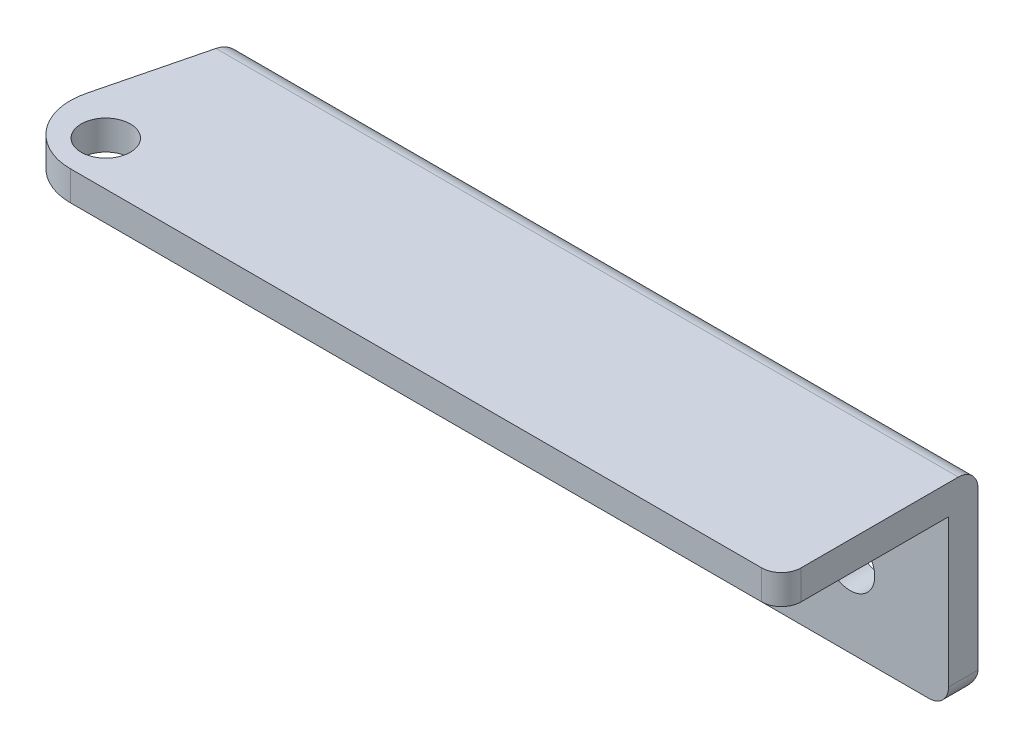
ISO-10303-21;
HEADER;
FILE_DESCRIPTION(('STEP AP214'),'2;1');
FILE_NAME('part.step','',(''),(''),'','','');
FILE_SCHEMA(('AUTOMOTIVE_DESIGN { 1 0 10303 214 1 1 1 1 }'));
ENDSEC;
DATA;
#1=APPLICATION_CONTEXT('core data for automotive mechanical design processes');
#2=APPLICATION_PROTOCOL_DEFINITION('international standard','automotive_design',2000,#1);
#3=PRODUCT_CONTEXT('',#1,'mechanical');
#4=PRODUCT('Part','Part','',(#3));
#5=PRODUCT_RELATED_PRODUCT_CATEGORY('part','',(#4));
#6=PRODUCT_DEFINITION_FORMATION('','',#4);
#7=PRODUCT_DEFINITION_CONTEXT('part definition',#1,'design');
#8=PRODUCT_DEFINITION('design','',#6,#7);
#9=PRODUCT_DEFINITION_SHAPE('','',#8);
#10=(LENGTH_UNIT() NAMED_UNIT(*) SI_UNIT(.MILLI.,.METRE.));
#11=(NAMED_UNIT(*) PLANE_ANGLE_UNIT() SI_UNIT($,.RADIAN.));
#12=(NAMED_UNIT(*) SI_UNIT($,.STERADIAN.) SOLID_ANGLE_UNIT());
#13=UNCERTAINTY_MEASURE_WITH_UNIT(LENGTH_MEASURE(1.E-05),#10,'distance_accuracy_value','');
#14=(GEOMETRIC_REPRESENTATION_CONTEXT(3) GLOBAL_UNCERTAINTY_ASSIGNED_CONTEXT((#13)) GLOBAL_UNIT_ASSIGNED_CONTEXT((#10,
#11,#12)) REPRESENTATION_CONTEXT('',''));
#15=CARTESIAN_POINT('',(0.,0.,0.));
#16=DIRECTION('',(0.,0.,1.));
#17=DIRECTION('',(1.,0.,0.));
#18=AXIS2_PLACEMENT_3D('',#15,#16,#17);
#19=CARTESIAN_POINT('',(0.,20.,0.));
#20=DIRECTION('',(1.,0.,0.));
#21=DIRECTION('',(0.,0.,-1.));
#22=AXIS2_PLACEMENT_3D('',#19,#20,#21);
#23=PLANE('',#22);
#24=DIRECTION('',(0.,-1.,0.));
#25=VECTOR('',#24,1.);
#26=CARTESIAN_POINT('',(0.,20.,-3.));
#27=LINE('',#26,#25);
#28=CARTESIAN_POINT('',(0.,17.,-3.));
#29=VERTEX_POINT('',#28);
#30=CARTESIAN_POINT('',(0.,2.,-3.));
#31=VERTEX_POINT('',#30);
#32=EDGE_CURVE('E218',#29,#31,#27,.T.);
#33=ORIENTED_EDGE('',*,*,#32,.T.);
#34=DIRECTION('',(0.,0.,1.));
#35=VECTOR('',#34,1.);
#36=CARTESIAN_POINT('',(0.,2.,0.));
#37=LINE('',#36,#35);
#38=CARTESIAN_POINT('',(0.,2.,0.));
#39=VERTEX_POINT('',#38);
#40=EDGE_CURVE('E60',#31,#39,#37,.T.);
#41=ORIENTED_EDGE('',*,*,#40,.T.);
#42=DIRECTION('',(0.,-1.,0.));
#43=VECTOR('',#42,1.);
#44=CARTESIAN_POINT('',(0.,20.,0.));
#45=LINE('',#44,#43);
#46=CARTESIAN_POINT('',(0.,17.,0.));
#47=VERTEX_POINT('',#46);
#48=EDGE_CURVE('E150',#47,#39,#45,.T.);
#49=ORIENTED_EDGE('',*,*,#48,.F.);
#50=DIRECTION('',(0.,0.,1.));
#51=VECTOR('',#50,1.);
#52=CARTESIAN_POINT('',(0.,17.,0.));
#53=LINE('',#52,#51);
#54=EDGE_CURVE('E131',#29,#47,#53,.T.);
#55=ORIENTED_EDGE('',*,*,#54,.F.);
#56=EDGE_LOOP('',(#33,#41,#49,#55));
#57=FACE_BOUND('',#56,.T.);
#58=ADVANCED_FACE('F37',(#57),#23,.F.);
#59=CARTESIAN_POINT('',(0.,20.,0.));
#60=DIRECTION('',(0.,0.,-1.));
#61=DIRECTION('',(-1.,0.,0.));
#62=AXIS2_PLACEMENT_3D('',#59,#60,#61);
#63=PLANE('',#62);
#64=CARTESIAN_POINT('',(65.,8.,0.));
#65=DIRECTION('',(0.,0.,1.));
#66=DIRECTION('',(1.,0.,0.));
#67=AXIS2_PLACEMENT_3D('',#64,#65,#66);
#68=CIRCLE('',#67,2.49999999999999);
#69=CARTESIAN_POINT('',(67.5,8.,0.));
#70=VERTEX_POINT('',#69);
#71=EDGE_CURVE('E464',#70,#70,#68,.T.);
#72=ORIENTED_EDGE('',*,*,#71,.F.);
#73=EDGE_LOOP('',(#72));
#74=FACE_BOUND('',#73,.T.);
#75=CARTESIAN_POINT('',(15.,8.,0.));
#76=DIRECTION('',(0.,0.,1.));
#77=DIRECTION('',(1.,0.,0.));
#78=AXIS2_PLACEMENT_3D('',#75,#76,#77);
#79=CIRCLE('',#78,2.5);
#80=CARTESIAN_POINT('',(17.5,8.,0.));
#81=VERTEX_POINT('',#80);
#82=EDGE_CURVE('E465',#81,#81,#79,.T.);
#83=ORIENTED_EDGE('',*,*,#82,.F.);
#84=EDGE_LOOP('',(#83));
#85=FACE_BOUND('',#84,.T.);
#86=ORIENTED_EDGE('',*,*,#48,.T.);
#87=CARTESIAN_POINT('',(2.,2.,0.));
#88=DIRECTION('',(0.,0.,-1.));
#89=DIRECTION('',(-1.,0.,0.));
#90=AXIS2_PLACEMENT_3D('',#87,#88,#89);
#91=CIRCLE('',#90,2.);
#92=CARTESIAN_POINT('',(2.,0.,0.));
#93=VERTEX_POINT('',#92);
#94=EDGE_CURVE('E193',#39,#93,#91,.F.);
#95=ORIENTED_EDGE('',*,*,#94,.T.);
#96=DIRECTION('',(1.,0.,0.));
#97=VECTOR('',#96,1.);
#98=CARTESIAN_POINT('',(0.,0.,0.));
#99=LINE('',#98,#97);
#100=CARTESIAN_POINT('',(73.,0.,0.));
#101=VERTEX_POINT('',#100);
#102=EDGE_CURVE('E219',#93,#101,#99,.T.);
#103=ORIENTED_EDGE('',*,*,#102,.T.);
#104=CARTESIAN_POINT('',(73.,2.,0.));
#105=DIRECTION('',(0.,0.,-1.));
#106=DIRECTION('',(-1.,0.,0.));
#107=AXIS2_PLACEMENT_3D('',#104,#105,#106);
#108=CIRCLE('',#107,2.);
#109=CARTESIAN_POINT('',(75.,2.,0.));
#110=VERTEX_POINT('',#109);
#111=EDGE_CURVE('E149',#101,#110,#108,.F.);
#112=ORIENTED_EDGE('',*,*,#111,.T.);
#113=DIRECTION('',(0.,-1.,0.));
#114=VECTOR('',#113,1.);
#115=CARTESIAN_POINT('',(75.,20.,0.));
#116=LINE('',#115,#114);
#117=CARTESIAN_POINT('',(75.,17.,0.));
#118=VERTEX_POINT('',#117);
#119=EDGE_CURVE('E139',#118,#110,#116,.T.);
#120=ORIENTED_EDGE('',*,*,#119,.F.);
#121=DIRECTION('',(1.,0.,0.));
#122=VECTOR('',#121,1.);
#123=CARTESIAN_POINT('',(0.,17.,0.));
#124=LINE('',#123,#122);
#125=EDGE_CURVE('E125',#47,#118,#124,.T.);
#126=ORIENTED_EDGE('',*,*,#125,.F.);
#127=EDGE_LOOP('',(#86,#95,#103,#112,#120,#126));
#128=FACE_BOUND('',#127,.T.);
#129=ADVANCED_FACE('F146',(#74,#85,#128),#63,.F.);
#130=CARTESIAN_POINT('',(75.,20.,0.));
#131=DIRECTION('',(-1.,0.,0.));
#132=DIRECTION('',(0.,0.,1.));
#133=AXIS2_PLACEMENT_3D('',#130,#131,#132);
#134=PLANE('',#133);
#135=DIRECTION('',(0.,-1.,0.));
#136=VECTOR('',#135,1.);
#137=CARTESIAN_POINT('',(75.,20.,-3.));
#138=LINE('',#137,#136);
#139=CARTESIAN_POINT('',(75.,18.,-3.));
#140=VERTEX_POINT('',#139);
#141=CARTESIAN_POINT('',(75.,2.,-3.));
#142=VERTEX_POINT('',#141);
#143=EDGE_CURVE('E151',#140,#142,#138,.T.);
#144=ORIENTED_EDGE('',*,*,#143,.F.);
#145=CARTESIAN_POINT('',(75.,18.,-1.));
#146=DIRECTION('',(-1.,0.,0.));
#147=DIRECTION('',(0.,0.,1.));
#148=AXIS2_PLACEMENT_3D('',#145,#146,#147);
#149=CIRCLE('',#148,2.);
#150=CARTESIAN_POINT('',(75.,20.,-1.));
#151=VERTEX_POINT('',#150);
#152=EDGE_CURVE('E189',#140,#151,#149,.F.);
#153=ORIENTED_EDGE('',*,*,#152,.T.);
#154=DIRECTION('',(0.,0.,-1.));
#155=VECTOR('',#154,1.);
#156=CARTESIAN_POINT('',(75.,20.,0.));
#157=LINE('',#156,#155);
#158=CARTESIAN_POINT('',(75.,20.,15.));
#159=VERTEX_POINT('',#158);
#160=EDGE_CURVE('E215',#159,#151,#157,.T.);
#161=ORIENTED_EDGE('',*,*,#160,.F.);
#162=DIRECTION('',(0.,1.,0.));
#163=VECTOR('',#162,1.);
#164=CARTESIAN_POINT('',(75.,17.,15.));
#165=LINE('',#164,#163);
#166=CARTESIAN_POINT('',(75.,17.,15.));
#167=VERTEX_POINT('',#166);
#168=EDGE_CURVE('E143',#159,#167,#165,.F.);
#169=ORIENTED_EDGE('',*,*,#168,.T.);
#170=DIRECTION('',(0.,0.,1.));
#171=VECTOR('',#170,1.);
#172=CARTESIAN_POINT('',(75.,17.,0.));
#173=LINE('',#172,#171);
#174=EDGE_CURVE('E128',#118,#167,#173,.T.);
#175=ORIENTED_EDGE('',*,*,#174,.F.);
#176=ORIENTED_EDGE('',*,*,#119,.T.);
#177=DIRECTION('',(0.,0.,-1.));
#178=VECTOR('',#177,1.);
#179=CARTESIAN_POINT('',(75.,2.,-3.));
#180=LINE('',#179,#178);
#181=EDGE_CURVE('E187',#110,#142,#180,.T.);
#182=ORIENTED_EDGE('',*,*,#181,.T.);
#183=EDGE_LOOP('',(#144,#153,#161,#169,#175,#176,#182));
#184=FACE_BOUND('',#183,.T.);
#185=ADVANCED_FACE('F138',(#184),#134,.F.);
#186=CARTESIAN_POINT('',(0.,20.,-3.));
#187=DIRECTION('',(0.,0.,1.));
#188=DIRECTION('',(1.,0.,0.));
#189=AXIS2_PLACEMENT_3D('',#186,#187,#188);
#190=PLANE('',#189);
#191=CARTESIAN_POINT('',(65.,8.,-3.));
#192=DIRECTION('',(0.,0.,1.));
#193=DIRECTION('',(1.,0.,0.));
#194=AXIS2_PLACEMENT_3D('',#191,#192,#193);
#195=CIRCLE('',#194,2.49999999999999);
#196=CARTESIAN_POINT('',(67.5,8.,-3.));
#197=VERTEX_POINT('',#196);
#198=EDGE_CURVE('E461',#197,#197,#195,.T.);
#199=ORIENTED_EDGE('',*,*,#198,.T.);
#200=EDGE_LOOP('',(#199));
#201=FACE_BOUND('',#200,.T.);
#202=CARTESIAN_POINT('',(15.,8.,-3.));
#203=DIRECTION('',(0.,0.,1.));
#204=DIRECTION('',(1.,0.,0.));
#205=AXIS2_PLACEMENT_3D('',#202,#203,#204);
#206=CIRCLE('',#205,2.5);
#207=CARTESIAN_POINT('',(17.5,8.,-3.));
#208=VERTEX_POINT('',#207);
#209=EDGE_CURVE('E470',#208,#208,#206,.T.);
#210=ORIENTED_EDGE('',*,*,#209,.T.);
#211=EDGE_LOOP('',(#210));
#212=FACE_BOUND('',#211,.T.);
#213=ORIENTED_EDGE('',*,*,#143,.T.);
#214=DIRECTION('',(-1.,0.,0.));
#215=VECTOR('',#214,1.);
#216=CARTESIAN_POINT('',(0.,2.,-3.));
#217=LINE('',#216,#215);
#218=EDGE_CURVE('E170',#142,#31,#217,.T.);
#219=ORIENTED_EDGE('',*,*,#218,.T.);
#220=ORIENTED_EDGE('',*,*,#32,.F.);
#221=CARTESIAN_POINT('',(0.,18.,-3.));
#222=VERTEX_POINT('',#221);
#223=EDGE_CURVE('E156',#222,#29,#27,.T.);
#224=ORIENTED_EDGE('',*,*,#223,.F.);
#225=DIRECTION('',(-1.,0.,0.));
#226=VECTOR('',#225,1.);
#227=CARTESIAN_POINT('',(0.,18.,-3.));
#228=LINE('',#227,#226);
#229=EDGE_CURVE('E168',#222,#140,#228,.F.);
#230=ORIENTED_EDGE('',*,*,#229,.T.);
#231=EDGE_LOOP('',(#213,#219,#220,#224,#230));
#232=FACE_BOUND('',#231,.T.);
#233=ADVANCED_FACE('F225',(#201,#212,#232),#190,.F.);
#234=CARTESIAN_POINT('',(0.,20.,0.));
#235=DIRECTION('',(0.,-1.,0.));
#236=DIRECTION('',(0.,0.,-1.));
#237=AXIS2_PLACEMENT_3D('',#234,#235,#236);
#238=PLANE('',#237);
#239=CARTESIAN_POINT('',(1.79427023522428,20.,12.5));
#240=DIRECTION('',(0.,1.,0.));
#241=DIRECTION('',(0.,0.,1.));
#242=AXIS2_PLACEMENT_3D('',#239,#240,#241);
#243=CIRCLE('',#242,2.5);
#244=CARTESIAN_POINT('',(1.79427023522428,20.,15.));
#245=VERTEX_POINT('',#244);
#246=EDGE_CURVE('E467',#245,#245,#243,.T.);
#247=ORIENTED_EDGE('',*,*,#246,.F.);
#248=EDGE_LOOP('',(#247));
#249=FACE_BOUND('',#248,.T.);
#250=ORIENTED_EDGE('',*,*,#160,.T.);
#251=DIRECTION('',(-1.,0.,0.));
#252=VECTOR('',#251,1.);
#253=CARTESIAN_POINT('',(0.,20.,-1.));
#254=LINE('',#253,#252);
#255=CARTESIAN_POINT('',(-0.5,20.,-1.));
#256=VERTEX_POINT('',#255);
#257=EDGE_CURVE('E181',#151,#256,#254,.T.);
#258=ORIENTED_EDGE('',*,*,#257,.T.);
#259=DIRECTION('',(-0.242535625036333,0.,0.970142500145332));
#260=VECTOR('',#259,1.);
#261=CARTESIAN_POINT('',(-0.705882352941176,20.,-0.176470588235294));
#262=LINE('',#261,#260);
#263=CARTESIAN_POINT('',(-3.1361965624455,20.,9.544786249782));
#264=VERTEX_POINT('',#263);
#265=EDGE_CURVE('E200',#256,#264,#262,.T.);
#266=ORIENTED_EDGE('',*,*,#265,.T.);
#267=CARTESIAN_POINT('',(2.68465843842649,20.,11.));
#268=DIRECTION('',(0.,-1.,0.));
#269=DIRECTION('',(0.,0.,-1.));
#270=AXIS2_PLACEMENT_3D('',#267,#268,#269);
#271=CIRCLE('',#270,6.);
#272=CARTESIAN_POINT('',(2.68465843842649,20.,17.));
#273=VERTEX_POINT('',#272);
#274=EDGE_CURVE('E162',#264,#273,#271,.F.);
#275=ORIENTED_EDGE('',*,*,#274,.T.);
#276=DIRECTION('',(1.,0.,0.));
#277=VECTOR('',#276,1.);
#278=CARTESIAN_POINT('',(0.,20.,17.));
#279=LINE('',#278,#277);
#280=CARTESIAN_POINT('',(73.,20.,17.));
#281=VERTEX_POINT('',#280);
#282=EDGE_CURVE('E205',#273,#281,#279,.T.);
#283=ORIENTED_EDGE('',*,*,#282,.T.);
#284=CARTESIAN_POINT('',(73.,20.,15.));
#285=DIRECTION('',(0.,-1.,0.));
#286=DIRECTION('',(0.,0.,-1.));
#287=AXIS2_PLACEMENT_3D('',#284,#285,#286);
#288=CIRCLE('',#287,2.);
#289=EDGE_CURVE('E179',#281,#159,#288,.F.);
#290=ORIENTED_EDGE('',*,*,#289,.T.);
#291=EDGE_LOOP('',(#250,#258,#266,#275,#283,#290));
#292=FACE_BOUND('',#291,.T.);
#293=ADVANCED_FACE('F243',(#249,#292),#238,.F.);
#294=CARTESIAN_POINT('',(0.,0.,0.));
#295=DIRECTION('',(0.,-1.,0.));
#296=DIRECTION('',(0.,0.,-1.));
#297=AXIS2_PLACEMENT_3D('',#294,#295,#296);
#298=PLANE('',#297);
#299=ORIENTED_EDGE('',*,*,#102,.F.);
#300=DIRECTION('',(0.,0.,1.));
#301=VECTOR('',#300,1.);
#302=CARTESIAN_POINT('',(2.,0.,-3.));
#303=LINE('',#302,#301);
#304=CARTESIAN_POINT('',(2.,0.,-1.));
#305=VERTEX_POINT('',#304);
#306=EDGE_CURVE('E177',#93,#305,#303,.F.);
#307=ORIENTED_EDGE('',*,*,#306,.T.);
#308=DIRECTION('',(-1.,0.,0.));
#309=VECTOR('',#308,1.);
#310=CARTESIAN_POINT('',(75.,0.,-1.));
#311=LINE('',#310,#309);
#312=CARTESIAN_POINT('',(73.,0.,-1.));
#313=VERTEX_POINT('',#312);
#314=EDGE_CURVE('E175',#305,#313,#311,.F.);
#315=ORIENTED_EDGE('',*,*,#314,.T.);
#316=DIRECTION('',(0.,0.,-1.));
#317=VECTOR('',#316,1.);
#318=CARTESIAN_POINT('',(73.,0.,0.));
#319=LINE('',#318,#317);
#320=EDGE_CURVE('E173',#313,#101,#319,.F.);
#321=ORIENTED_EDGE('',*,*,#320,.T.);
#322=EDGE_LOOP('',(#299,#307,#315,#321));
#323=FACE_BOUND('',#322,.T.);
#324=ADVANCED_FACE('F235',(#323),#298,.T.);
#325=CARTESIAN_POINT('',(-0.705882352941176,17.,-0.176470588235294));
#326=DIRECTION('',(-0.970142500145332,0.,-0.242535625036333));
#327=DIRECTION('',(-0.242535625036333,0.,0.970142500145332));
#328=AXIS2_PLACEMENT_3D('',#325,#326,#327);
#329=PLANE('',#328);
#330=ORIENTED_EDGE('',*,*,#265,.F.);
#331=CARTESIAN_POINT('',(-0.5,18.,-1.));
#332=DIRECTION('',(-0.970142500145332,0.,-0.242535625036333));
#333=DIRECTION('',(-0.242535625036333,0.,0.970142500145332));
#334=AXIS2_PLACEMENT_3D('',#331,#332,#333);
#335=ELLIPSE('',#334,2.06155281280883,2.);
#336=EDGE_CURVE('E184',#256,#222,#335,.T.);
#337=ORIENTED_EDGE('',*,*,#336,.T.);
#338=ORIENTED_EDGE('',*,*,#223,.T.);
#339=DIRECTION('',(-0.242535625036333,0.,0.970142500145332));
#340=VECTOR('',#339,1.);
#341=CARTESIAN_POINT('',(-0.705882352941176,17.,-0.176470588235294));
#342=LINE('',#341,#340);
#343=CARTESIAN_POINT('',(-3.1361965624455,17.,9.544786249782));
#344=VERTEX_POINT('',#343);
#345=EDGE_CURVE('E211',#29,#344,#342,.T.);
#346=ORIENTED_EDGE('',*,*,#345,.T.);
#347=DIRECTION('',(0.,1.,0.));
#348=VECTOR('',#347,1.);
#349=CARTESIAN_POINT('',(-3.1361965624455,17.,9.544786249782));
#350=LINE('',#349,#348);
#351=EDGE_CURVE('E153',#344,#264,#350,.T.);
#352=ORIENTED_EDGE('',*,*,#351,.T.);
#353=EDGE_LOOP('',(#330,#337,#338,#346,#352));
#354=FACE_BOUND('',#353,.T.);
#355=ADVANCED_FACE('F244',(#354),#329,.T.);
#356=CARTESIAN_POINT('',(0.,17.,17.));
#357=DIRECTION('',(0.,0.,1.));
#358=DIRECTION('',(1.,0.,0.));
#359=AXIS2_PLACEMENT_3D('',#356,#357,#358);
#360=PLANE('',#359);
#361=DIRECTION('',(1.,0.,0.));
#362=VECTOR('',#361,1.);
#363=CARTESIAN_POINT('',(0.,17.,17.));
#364=LINE('',#363,#362);
#365=CARTESIAN_POINT('',(2.68465843842649,17.,17.));
#366=VERTEX_POINT('',#365);
#367=CARTESIAN_POINT('',(73.,17.,17.));
#368=VERTEX_POINT('',#367);
#369=EDGE_CURVE('E144',#366,#368,#364,.T.);
#370=ORIENTED_EDGE('',*,*,#369,.T.);
#371=DIRECTION('',(0.,1.,0.));
#372=VECTOR('',#371,1.);
#373=CARTESIAN_POINT('',(73.,20.,17.));
#374=LINE('',#373,#372);
#375=EDGE_CURVE('E46',#368,#281,#374,.T.);
#376=ORIENTED_EDGE('',*,*,#375,.T.);
#377=ORIENTED_EDGE('',*,*,#282,.F.);
#378=DIRECTION('',(0.,1.,0.));
#379=VECTOR('',#378,1.);
#380=CARTESIAN_POINT('',(2.68465843842649,17.,17.));
#381=LINE('',#380,#379);
#382=EDGE_CURVE('E164',#273,#366,#381,.F.);
#383=ORIENTED_EDGE('',*,*,#382,.T.);
#384=EDGE_LOOP('',(#370,#376,#377,#383));
#385=FACE_BOUND('',#384,.T.);
#386=ADVANCED_FACE('F252',(#385),#360,.T.);
#387=CARTESIAN_POINT('',(0.,17.,0.));
#388=DIRECTION('',(0.,1.,0.));
#389=DIRECTION('',(0.,0.,1.));
#390=AXIS2_PLACEMENT_3D('',#387,#388,#389);
#391=PLANE('',#390);
#392=CARTESIAN_POINT('',(1.79427023522428,17.,12.5));
#393=DIRECTION('',(0.,1.,0.));
#394=DIRECTION('',(0.,0.,1.));
#395=AXIS2_PLACEMENT_3D('',#392,#393,#394);
#396=CIRCLE('',#395,2.5);
#397=CARTESIAN_POINT('',(1.79427023522428,17.,15.));
#398=VERTEX_POINT('',#397);
#399=EDGE_CURVE('E41',#398,#398,#396,.T.);
#400=ORIENTED_EDGE('',*,*,#399,.T.);
#401=EDGE_LOOP('',(#400));
#402=FACE_BOUND('',#401,.T.);
#403=ORIENTED_EDGE('',*,*,#174,.T.);
#404=CARTESIAN_POINT('',(73.,17.,15.));
#405=DIRECTION('',(0.,1.,0.));
#406=DIRECTION('',(0.,0.,1.));
#407=AXIS2_PLACEMENT_3D('',#404,#405,#406);
#408=CIRCLE('',#407,2.);
#409=EDGE_CURVE('E11',#167,#368,#408,.F.);
#410=ORIENTED_EDGE('',*,*,#409,.T.);
#411=ORIENTED_EDGE('',*,*,#369,.F.);
#412=CARTESIAN_POINT('',(2.68465843842649,17.,11.));
#413=DIRECTION('',(0.,1.,0.));
#414=DIRECTION('',(0.,0.,1.));
#415=AXIS2_PLACEMENT_3D('',#412,#413,#414);
#416=CIRCLE('',#415,6.);
#417=EDGE_CURVE('E166',#366,#344,#416,.F.);
#418=ORIENTED_EDGE('',*,*,#417,.T.);
#419=ORIENTED_EDGE('',*,*,#345,.F.);
#420=ORIENTED_EDGE('',*,*,#54,.T.);
#421=ORIENTED_EDGE('',*,*,#125,.T.);
#422=EDGE_LOOP('',(#403,#410,#411,#418,#419,#420,#421));
#423=FACE_BOUND('',#422,.T.);
#424=ADVANCED_FACE('F127',(#402,#423),#391,.F.);
#425=CARTESIAN_POINT('',(2.68465843842649,17.,11.));
#426=DIRECTION('',(0.,1.,0.));
#427=DIRECTION('',(0.,0.,1.));
#428=AXIS2_PLACEMENT_3D('',#425,#426,#427);
#429=CYLINDRICAL_SURFACE('',#428,6.);
#430=ORIENTED_EDGE('',*,*,#417,.F.);
#431=ORIENTED_EDGE('',*,*,#382,.F.);
#432=ORIENTED_EDGE('',*,*,#274,.F.);
#433=ORIENTED_EDGE('',*,*,#351,.F.);
#434=EDGE_LOOP('',(#430,#431,#432,#433));
#435=FACE_BOUND('',#434,.T.);
#436=ADVANCED_FACE('F248',(#435),#429,.T.);
#437=CARTESIAN_POINT('',(73.,2.,0.));
#438=DIRECTION('',(0.,0.,1.));
#439=DIRECTION('',(1.,0.,0.));
#440=AXIS2_PLACEMENT_3D('',#437,#438,#439);
#441=CYLINDRICAL_SURFACE('',#440,2.);
#442=ORIENTED_EDGE('',*,*,#111,.F.);
#443=ORIENTED_EDGE('',*,*,#320,.F.);
#444=CARTESIAN_POINT('',(73.,2.,-1.));
#445=DIRECTION('',(0.707106781186547,0.,0.707106781186547));
#446=DIRECTION('',(-0.707106781186547,0.,0.707106781186547));
#447=AXIS2_PLACEMENT_3D('',#444,#445,#446);
#448=ELLIPSE('',#447,2.82842712474619,2.);
#449=EDGE_CURVE('E198',#142,#313,#448,.F.);
#450=ORIENTED_EDGE('',*,*,#449,.F.);
#451=ORIENTED_EDGE('',*,*,#181,.F.);
#452=EDGE_LOOP('',(#442,#443,#450,#451));
#453=FACE_BOUND('',#452,.T.);
#454=ADVANCED_FACE('F238',(#453),#441,.T.);
#455=CARTESIAN_POINT('',(2.,2.,0.));
#456=DIRECTION('',(0.,0.,-1.));
#457=DIRECTION('',(-1.,0.,0.));
#458=AXIS2_PLACEMENT_3D('',#455,#456,#457);
#459=CYLINDRICAL_SURFACE('',#458,2.);
#460=ORIENTED_EDGE('',*,*,#94,.F.);
#461=ORIENTED_EDGE('',*,*,#40,.F.);
#462=CARTESIAN_POINT('',(2.,2.,-1.));
#463=DIRECTION('',(0.707106781186547,0.,-0.707106781186547));
#464=DIRECTION('',(-0.707106781186547,0.,-0.707106781186547));
#465=AXIS2_PLACEMENT_3D('',#462,#463,#464);
#466=ELLIPSE('',#465,2.82842712474619,2.);
#467=EDGE_CURVE('E197',#305,#31,#466,.T.);
#468=ORIENTED_EDGE('',*,*,#467,.F.);
#469=ORIENTED_EDGE('',*,*,#306,.F.);
#470=EDGE_LOOP('',(#460,#461,#468,#469));
#471=FACE_BOUND('',#470,.T.);
#472=ADVANCED_FACE('F232',(#471),#459,.T.);
#473=CARTESIAN_POINT('',(0.,2.,-1.));
#474=DIRECTION('',(1.,0.,0.));
#475=DIRECTION('',(0.,0.,-1.));
#476=AXIS2_PLACEMENT_3D('',#473,#474,#475);
#477=CYLINDRICAL_SURFACE('',#476,2.);
#478=ORIENTED_EDGE('',*,*,#449,.T.);
#479=ORIENTED_EDGE('',*,*,#314,.F.);
#480=ORIENTED_EDGE('',*,*,#467,.T.);
#481=ORIENTED_EDGE('',*,*,#218,.F.);
#482=EDGE_LOOP('',(#478,#479,#480,#481));
#483=FACE_BOUND('',#482,.T.);
#484=ADVANCED_FACE('F227',(#483),#477,.T.);
#485=CARTESIAN_POINT('',(0.,18.,-1.));
#486=DIRECTION('',(-1.,0.,0.));
#487=DIRECTION('',(0.,0.,1.));
#488=AXIS2_PLACEMENT_3D('',#485,#486,#487);
#489=CYLINDRICAL_SURFACE('',#488,2.);
#490=ORIENTED_EDGE('',*,*,#152,.F.);
#491=ORIENTED_EDGE('',*,*,#229,.F.);
#492=ORIENTED_EDGE('',*,*,#336,.F.);
#493=ORIENTED_EDGE('',*,*,#257,.F.);
#494=EDGE_LOOP('',(#490,#491,#492,#493));
#495=FACE_BOUND('',#494,.T.);
#496=ADVANCED_FACE('F242',(#495),#489,.T.);
#497=CARTESIAN_POINT('',(73.,17.,15.));
#498=DIRECTION('',(0.,-1.,0.));
#499=DIRECTION('',(0.,0.,-1.));
#500=AXIS2_PLACEMENT_3D('',#497,#498,#499);
#501=CYLINDRICAL_SURFACE('',#500,2.);
#502=ORIENTED_EDGE('',*,*,#409,.F.);
#503=ORIENTED_EDGE('',*,*,#168,.F.);
#504=ORIENTED_EDGE('',*,*,#289,.F.);
#505=ORIENTED_EDGE('',*,*,#375,.F.);
#506=EDGE_LOOP('',(#502,#503,#504,#505));
#507=FACE_BOUND('',#506,.T.);
#508=ADVANCED_FACE('F39',(#507),#501,.T.);
#509=CARTESIAN_POINT('',(1.79427023522428,0.,12.5));
#510=DIRECTION('',(0.,1.,0.));
#511=DIRECTION('',(0.,0.,1.));
#512=AXIS2_PLACEMENT_3D('',#509,#510,#511);
#513=CYLINDRICAL_SURFACE('',#512,2.5);
#514=ORIENTED_EDGE('',*,*,#246,.T.);
#515=EDGE_LOOP('',(#514));
#516=FACE_BOUND('',#515,.T.);
#517=ORIENTED_EDGE('',*,*,#399,.F.);
#518=EDGE_LOOP('',(#517));
#519=FACE_BOUND('',#518,.T.);
#520=ADVANCED_FACE('F256',(#516,#519),#513,.F.);
#521=CARTESIAN_POINT('',(15.,8.,-3.));
#522=DIRECTION('',(0.,0.,1.));
#523=DIRECTION('',(1.,0.,0.));
#524=AXIS2_PLACEMENT_3D('',#521,#522,#523);
#525=CYLINDRICAL_SURFACE('',#524,2.5);
#526=ORIENTED_EDGE('',*,*,#209,.F.);
#527=EDGE_LOOP('',(#526));
#528=FACE_BOUND('',#527,.T.);
#529=ORIENTED_EDGE('',*,*,#82,.T.);
#530=EDGE_LOOP('',(#529));
#531=FACE_BOUND('',#530,.T.);
#532=ADVANCED_FACE('F261',(#528,#531),#525,.F.);
#533=CARTESIAN_POINT('',(65.,8.,-3.));
#534=DIRECTION('',(0.,0.,1.));
#535=DIRECTION('',(1.,0.,0.));
#536=AXIS2_PLACEMENT_3D('',#533,#534,#535);
#537=CYLINDRICAL_SURFACE('',#536,2.49999999999999);
#538=ORIENTED_EDGE('',*,*,#198,.F.);
#539=EDGE_LOOP('',(#538));
#540=FACE_BOUND('',#539,.T.);
#541=ORIENTED_EDGE('',*,*,#71,.T.);
#542=EDGE_LOOP('',(#541));
#543=FACE_BOUND('',#542,.T.);
#544=ADVANCED_FACE('F364',(#540,#543),#537,.F.);
#545=CLOSED_SHELL('',(#58,#129,#185,#233,#293,#324,#355,#386,#424,#436,#454,#472,#484,#496,#508,
#520,#532,#544));
#546=MANIFOLD_SOLID_BREP('B2',#545);
#547=ADVANCED_BREP_SHAPE_REPRESENTATION('',(#18,#546),#14);
#548=SHAPE_DEFINITION_REPRESENTATION(#9,#547);
ENDSEC;
END-ISO-10303-21;
